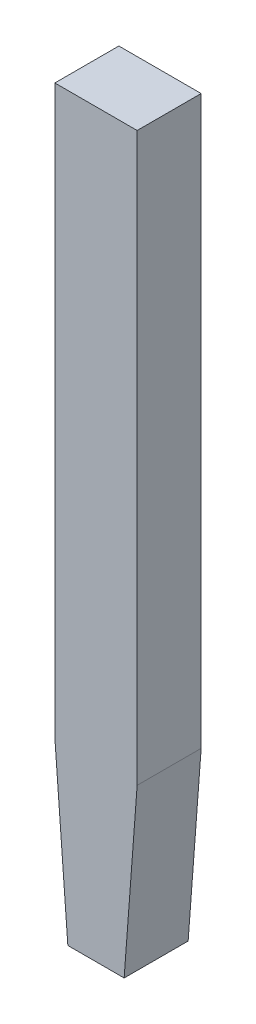
ISO-10303-21;
HEADER;
FILE_DESCRIPTION(('STEP AP214'),'2;1');
FILE_NAME('part.step','',(''),(''),'','','');
FILE_SCHEMA(('AUTOMOTIVE_DESIGN { 1 0 10303 214 1 1 1 1 }'));
ENDSEC;
DATA;
#1=APPLICATION_CONTEXT('core data for automotive mechanical design processes');
#2=APPLICATION_PROTOCOL_DEFINITION('international standard','automotive_design',2000,#1);
#3=PRODUCT_CONTEXT('',#1,'mechanical');
#4=PRODUCT('Part','Part','',(#3));
#5=PRODUCT_RELATED_PRODUCT_CATEGORY('part','',(#4));
#6=PRODUCT_DEFINITION_FORMATION('','',#4);
#7=PRODUCT_DEFINITION_CONTEXT('part definition',#1,'design');
#8=PRODUCT_DEFINITION('design','',#6,#7);
#9=PRODUCT_DEFINITION_SHAPE('','',#8);
#10=(LENGTH_UNIT() NAMED_UNIT(*) SI_UNIT(.MILLI.,.METRE.));
#11=(NAMED_UNIT(*) PLANE_ANGLE_UNIT() SI_UNIT($,.RADIAN.));
#12=(NAMED_UNIT(*) SI_UNIT($,.STERADIAN.) SOLID_ANGLE_UNIT());
#13=UNCERTAINTY_MEASURE_WITH_UNIT(LENGTH_MEASURE(1.E-05),#10,'distance_accuracy_value','');
#14=(GEOMETRIC_REPRESENTATION_CONTEXT(3) GLOBAL_UNCERTAINTY_ASSIGNED_CONTEXT((#13)) GLOBAL_UNIT_ASSIGNED_CONTEXT((#10,
#11,#12)) REPRESENTATION_CONTEXT('',''));
#15=CARTESIAN_POINT('',(0.,0.,0.));
#16=DIRECTION('',(0.,0.,1.));
#17=DIRECTION('',(1.,0.,0.));
#18=AXIS2_PLACEMENT_3D('',#15,#16,#17);
#19=CARTESIAN_POINT('',(55.49457889831,1.696835055312,3.705000000046));
#20=DIRECTION('',(0.,0.,1.));
#21=DIRECTION('',(1.,0.,0.));
#22=AXIS2_PLACEMENT_3D('',#19,#20,#21);
#23=PLANE('',#22);
#24=DIRECTION('',(1.,0.,0.));
#25=VECTOR('',#24,1.);
#26=CARTESIAN_POINT('',(38.93957889831,-15.17126218978,3.705000000046));
#27=LINE('',#26,#25);
#28=CARTESIAN_POINT('',(57.0606861916904,-15.17126218978,3.705000000046));
#29=VERTEX_POINT('',#28);
#30=CARTESIAN_POINT('',(57.3684716049296,-15.17126218978,3.705000000046));
#31=VERTEX_POINT('',#30);
#32=EDGE_CURVE('E94',#29,#31,#27,.T.);
#33=ORIENTED_EDGE('',*,*,#32,.T.);
#34=DIRECTION('',(0.0747899482416168,0.997199309888458,0.));
#35=VECTOR('',#34,1.);
#36=CARTESIAN_POINT('',(57.43957889831,-14.22316494469,3.705000000046));
#37=LINE('',#36,#35);
#38=CARTESIAN_POINT('',(57.43957889831,-14.2231649446905,3.705000000046));
#39=VERTEX_POINT('',#38);
#40=EDGE_CURVE('E98',#39,#31,#37,.F.);
#41=ORIENTED_EDGE('',*,*,#40,.F.);
#42=DIRECTION('',(0.,1.,0.));
#43=VECTOR('',#42,1.);
#44=CARTESIAN_POINT('',(57.43957889831,-10.46816494469,3.705000000046));
#45=LINE('',#44,#43);
#46=CARTESIAN_POINT('',(57.43957889831,-11.12202888849,3.705000000046));
#47=VERTEX_POINT('',#46);
#48=EDGE_CURVE('E83',#47,#39,#45,.F.);
#49=ORIENTED_EDGE('',*,*,#48,.F.);
#50=DIRECTION('',(1.,0.,0.));
#51=VECTOR('',#50,1.);
#52=CARTESIAN_POINT('',(44.47457889831,-11.12202888849,3.705000000046));
#53=LINE('',#52,#51);
#54=CARTESIAN_POINT('',(56.98957889831,-11.12202888849,3.705000000046));
#55=VERTEX_POINT('',#54);
#56=EDGE_CURVE('E20',#47,#55,#53,.F.);
#57=ORIENTED_EDGE('',*,*,#56,.T.);
#58=DIRECTION('',(0.,1.,0.));
#59=VECTOR('',#58,1.);
#60=CARTESIAN_POINT('',(56.98957889831,-10.46816494469,3.705000000046));
#61=LINE('',#60,#59);
#62=CARTESIAN_POINT('',(56.98957889831,-14.2231649446899,3.705000000046));
#63=VERTEX_POINT('',#62);
#64=EDGE_CURVE('E71',#63,#55,#61,.T.);
#65=ORIENTED_EDGE('',*,*,#64,.F.);
#66=DIRECTION('',(0.0747899482416168,-0.997199309888458,0.));
#67=VECTOR('',#66,1.);
#68=CARTESIAN_POINT('',(56.98957889831,-14.22316494469,3.705000000046));
#69=LINE('',#68,#67);
#70=EDGE_CURVE('E66',#29,#63,#69,.F.);
#71=ORIENTED_EDGE('',*,*,#70,.F.);
#72=EDGE_LOOP('',(#33,#41,#49,#57,#65,#71));
#73=FACE_BOUND('',#72,.T.);
#74=ADVANCED_FACE('F17',(#73),#23,.T.);
#75=CARTESIAN_POINT('',(44.47457889831,-11.12202888849,-0.158278306686));
#76=DIRECTION('',(0.,-1.,0.));
#77=DIRECTION('',(0.,0.,-1.));
#78=AXIS2_PLACEMENT_3D('',#75,#76,#77);
#79=PLANE('',#78);
#80=DIRECTION('',(1.,0.,0.));
#81=VECTOR('',#80,1.);
#82=CARTESIAN_POINT('',(55.49457889831,-11.12202888849,3.355000000046));
#83=LINE('',#82,#81);
#84=CARTESIAN_POINT('',(57.43957889831,-11.12202888849,3.355000000046));
#85=VERTEX_POINT('',#84);
#86=CARTESIAN_POINT('',(56.98957889831,-11.12202888849,3.355000000046));
#87=VERTEX_POINT('',#86);
#88=EDGE_CURVE('E89',#85,#87,#83,.F.);
#89=ORIENTED_EDGE('',*,*,#88,.T.);
#90=DIRECTION('',(0.,0.,1.));
#91=VECTOR('',#90,1.);
#92=CARTESIAN_POINT('',(56.98957889831,-11.12202888849,3.355000000046));
#93=LINE('',#92,#91);
#94=EDGE_CURVE('E76',#55,#87,#93,.F.);
#95=ORIENTED_EDGE('',*,*,#94,.F.);
#96=ORIENTED_EDGE('',*,*,#56,.F.);
#97=DIRECTION('',(0.,0.,-1.));
#98=VECTOR('',#97,1.);
#99=CARTESIAN_POINT('',(57.43957889831,-11.12202888849,3.355000000046));
#100=LINE('',#99,#98);
#101=EDGE_CURVE('E102',#85,#47,#100,.F.);
#102=ORIENTED_EDGE('',*,*,#101,.F.);
#103=EDGE_LOOP('',(#89,#95,#96,#102));
#104=FACE_BOUND('',#103,.T.);
#105=ADVANCED_FACE('F88',(#104),#79,.F.);
#106=CARTESIAN_POINT('',(56.98957889831,-10.46816494469,3.355000000046));
#107=DIRECTION('',(-1.,0.,0.));
#108=DIRECTION('',(0.,0.,1.));
#109=AXIS2_PLACEMENT_3D('',#106,#107,#108);
#110=PLANE('',#109);
#111=DIRECTION('',(0.,1.,0.));
#112=VECTOR('',#111,1.);
#113=CARTESIAN_POINT('',(56.98957889831,1.696835055312,3.355000000046));
#114=LINE('',#113,#112);
#115=CARTESIAN_POINT('',(56.98957889831,-14.2231649446899,3.355000000046));
#116=VERTEX_POINT('',#115);
#117=EDGE_CURVE('E107',#87,#116,#114,.F.);
#118=ORIENTED_EDGE('',*,*,#117,.T.);
#119=DIRECTION('',(0.,0.,1.));
#120=VECTOR('',#119,1.);
#121=CARTESIAN_POINT('',(56.98957889831,-14.22316494469,3.355000000046));
#122=LINE('',#121,#120);
#123=EDGE_CURVE('E78',#63,#116,#122,.F.);
#124=ORIENTED_EDGE('',*,*,#123,.F.);
#125=ORIENTED_EDGE('',*,*,#64,.T.);
#126=ORIENTED_EDGE('',*,*,#94,.T.);
#127=EDGE_LOOP('',(#118,#124,#125,#126));
#128=FACE_BOUND('',#127,.T.);
#129=ADVANCED_FACE('F74',(#128),#110,.T.);
#130=CARTESIAN_POINT('',(56.98957889831,-14.22316494469,3.355000000046));
#131=DIRECTION('',(-0.997199309888458,-0.0747899482416168,0.));
#132=DIRECTION('',(0.0747899482416168,-0.997199309888458,0.));
#133=AXIS2_PLACEMENT_3D('',#130,#131,#132);
#134=PLANE('',#133);
#135=ORIENTED_EDGE('',*,*,#70,.T.);
#136=ORIENTED_EDGE('',*,*,#123,.T.);
#137=DIRECTION('',(0.0747899482398054,-0.997199309888594,0.));
#138=VECTOR('',#137,1.);
#139=CARTESIAN_POINT('',(56.98957889831,-14.22316494469,3.355000000046));
#140=LINE('',#139,#138);
#141=CARTESIAN_POINT('',(57.0606861916909,-15.1712621897799,3.355000000046));
#142=VERTEX_POINT('',#141);
#143=EDGE_CURVE('E109',#116,#142,#140,.T.);
#144=ORIENTED_EDGE('',*,*,#143,.T.);
#145=DIRECTION('',(0.,0.,1.));
#146=VECTOR('',#145,1.);
#147=CARTESIAN_POINT('',(57.06068619169,-15.17126218978,-0.8137967800219));
#148=LINE('',#147,#146);
#149=EDGE_CURVE('E96',#142,#29,#148,.T.);
#150=ORIENTED_EDGE('',*,*,#149,.T.);
#151=EDGE_LOOP('',(#135,#136,#144,#150));
#152=FACE_BOUND('',#151,.T.);
#153=ADVANCED_FACE('F126',(#152),#134,.T.);
#154=CARTESIAN_POINT('',(38.93957889831,-15.17126218978,-0.8137967800219));
#155=DIRECTION('',(0.,1.,0.));
#156=DIRECTION('',(0.,0.,1.));
#157=AXIS2_PLACEMENT_3D('',#154,#155,#156);
#158=PLANE('',#157);
#159=DIRECTION('',(1.,0.,0.));
#160=VECTOR('',#159,1.);
#161=CARTESIAN_POINT('',(55.49457889831,-15.17126218978,3.355000000046));
#162=LINE('',#161,#160);
#163=CARTESIAN_POINT('',(57.3684716049296,-15.17126218978,3.355000000046));
#164=VERTEX_POINT('',#163);
#165=EDGE_CURVE('E112',#142,#164,#162,.T.);
#166=ORIENTED_EDGE('',*,*,#165,.T.);
#167=DIRECTION('',(0.,0.,1.));
#168=VECTOR('',#167,1.);
#169=CARTESIAN_POINT('',(57.3684716049283,-15.1712621897799,3.355000000046));
#170=LINE('',#169,#168);
#171=EDGE_CURVE('E100',#31,#164,#170,.F.);
#172=ORIENTED_EDGE('',*,*,#171,.F.);
#173=ORIENTED_EDGE('',*,*,#32,.F.);
#174=ORIENTED_EDGE('',*,*,#149,.F.);
#175=EDGE_LOOP('',(#166,#172,#173,#174));
#176=FACE_BOUND('',#175,.T.);
#177=ADVANCED_FACE('F125',(#176),#158,.F.);
#178=CARTESIAN_POINT('',(57.43957889831,-14.22316494469,3.355000000046));
#179=DIRECTION('',(0.997199309888458,-0.0747899482416168,0.));
#180=DIRECTION('',(0.0747899482416168,0.997199309888458,0.));
#181=AXIS2_PLACEMENT_3D('',#178,#179,#180);
#182=PLANE('',#181);
#183=DIRECTION('',(0.0747899482398127,0.997199309888593,0.));
#184=VECTOR('',#183,1.);
#185=CARTESIAN_POINT('',(57.36847160493,-15.17126218978,3.355000000046));
#186=LINE('',#185,#184);
#187=CARTESIAN_POINT('',(57.43957889831,-14.22316494469,3.355000000046));
#188=VERTEX_POINT('',#187);
#189=EDGE_CURVE('E26',#164,#188,#186,.T.);
#190=ORIENTED_EDGE('',*,*,#189,.T.);
#191=DIRECTION('',(0.,0.,-1.));
#192=VECTOR('',#191,1.);
#193=CARTESIAN_POINT('',(57.43957889831,-14.22316494469,3.355000000046));
#194=LINE('',#193,#192);
#195=EDGE_CURVE('E34',#39,#188,#194,.T.);
#196=ORIENTED_EDGE('',*,*,#195,.F.);
#197=ORIENTED_EDGE('',*,*,#40,.T.);
#198=ORIENTED_EDGE('',*,*,#171,.T.);
#199=EDGE_LOOP('',(#190,#196,#197,#198));
#200=FACE_BOUND('',#199,.T.);
#201=ADVANCED_FACE('F118',(#200),#182,.T.);
#202=CARTESIAN_POINT('',(57.43957889831,-10.46816494469,3.355000000046));
#203=DIRECTION('',(1.,0.,0.));
#204=DIRECTION('',(0.,0.,-1.));
#205=AXIS2_PLACEMENT_3D('',#202,#203,#204);
#206=PLANE('',#205);
#207=ORIENTED_EDGE('',*,*,#48,.T.);
#208=ORIENTED_EDGE('',*,*,#195,.T.);
#209=DIRECTION('',(0.,1.,0.));
#210=VECTOR('',#209,1.);
#211=CARTESIAN_POINT('',(57.43957889831,1.696835055312,3.355000000046));
#212=LINE('',#211,#210);
#213=EDGE_CURVE('E11',#188,#85,#212,.T.);
#214=ORIENTED_EDGE('',*,*,#213,.T.);
#215=ORIENTED_EDGE('',*,*,#101,.T.);
#216=EDGE_LOOP('',(#207,#208,#214,#215));
#217=FACE_BOUND('',#216,.T.);
#218=ADVANCED_FACE('F127',(#217),#206,.T.);
#219=CARTESIAN_POINT('',(55.49457889831,1.696835055312,3.355000000046));
#220=DIRECTION('',(0.,0.,1.));
#221=DIRECTION('',(1.,0.,0.));
#222=AXIS2_PLACEMENT_3D('',#219,#220,#221);
#223=PLANE('',#222);
#224=ORIENTED_EDGE('',*,*,#189,.F.);
#225=ORIENTED_EDGE('',*,*,#165,.F.);
#226=ORIENTED_EDGE('',*,*,#143,.F.);
#227=ORIENTED_EDGE('',*,*,#117,.F.);
#228=ORIENTED_EDGE('',*,*,#88,.F.);
#229=ORIENTED_EDGE('',*,*,#213,.F.);
#230=EDGE_LOOP('',(#224,#225,#226,#227,#228,#229));
#231=FACE_BOUND('',#230,.T.);
#232=ADVANCED_FACE('F122',(#231),#223,.F.);
#233=CLOSED_SHELL('',(#74,#105,#129,#153,#177,#201,#218,#232));
#234=MANIFOLD_SOLID_BREP('B1',#233);
#235=ADVANCED_BREP_SHAPE_REPRESENTATION('',(#18,#234),#14);
#236=SHAPE_DEFINITION_REPRESENTATION(#9,#235);
ENDSEC;
END-ISO-10303-21;
